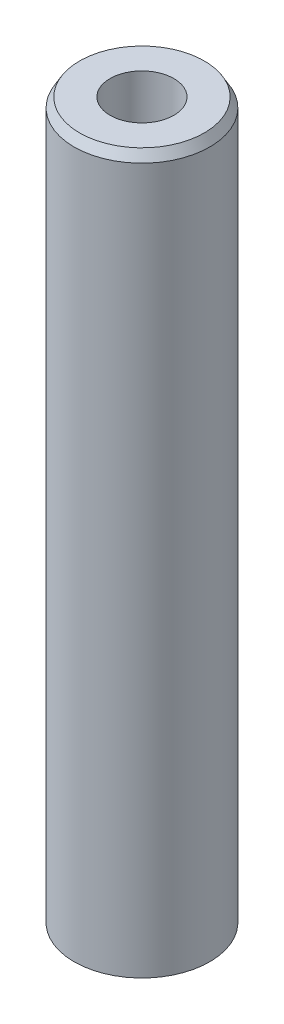
ISO-10303-21;
HEADER;
FILE_DESCRIPTION(('STEP AP214'),'2;1');
FILE_NAME('part.step','',(''),(''),'','','');
FILE_SCHEMA(('AUTOMOTIVE_DESIGN { 1 0 10303 214 1 1 1 1 }'));
ENDSEC;
DATA;
#1=APPLICATION_CONTEXT('core data for automotive mechanical design processes');
#2=APPLICATION_PROTOCOL_DEFINITION('international standard','automotive_design',2000,#1);
#3=PRODUCT_CONTEXT('',#1,'mechanical');
#4=PRODUCT('Part','Part','',(#3));
#5=PRODUCT_RELATED_PRODUCT_CATEGORY('part','',(#4));
#6=PRODUCT_DEFINITION_FORMATION('','',#4);
#7=PRODUCT_DEFINITION_CONTEXT('part definition',#1,'design');
#8=PRODUCT_DEFINITION('design','',#6,#7);
#9=PRODUCT_DEFINITION_SHAPE('','',#8);
#10=(LENGTH_UNIT() NAMED_UNIT(*) SI_UNIT(.MILLI.,.METRE.));
#11=(NAMED_UNIT(*) PLANE_ANGLE_UNIT() SI_UNIT($,.RADIAN.));
#12=(NAMED_UNIT(*) SI_UNIT($,.STERADIAN.) SOLID_ANGLE_UNIT());
#13=UNCERTAINTY_MEASURE_WITH_UNIT(LENGTH_MEASURE(1.E-05),#10,'distance_accuracy_value','');
#14=(GEOMETRIC_REPRESENTATION_CONTEXT(3) GLOBAL_UNCERTAINTY_ASSIGNED_CONTEXT((#13)) GLOBAL_UNIT_ASSIGNED_CONTEXT((#10,
#11,#12)) REPRESENTATION_CONTEXT('',''));
#15=CARTESIAN_POINT('',(0.,0.,0.));
#16=DIRECTION('',(0.,0.,1.));
#17=DIRECTION('',(1.,0.,0.));
#18=AXIS2_PLACEMENT_3D('',#15,#16,#17);
#19=CARTESIAN_POINT('',(0.,212.45765458516,0.));
#20=DIRECTION('',(0.,-1.,0.));
#21=DIRECTION('',(0.,0.,-1.));
#22=AXIS2_PLACEMENT_3D('',#19,#20,#21);
#23=CYLINDRICAL_SURFACE('',#22,20.);
#24=CARTESIAN_POINT('',(0.,209.670040838824,0.));
#25=DIRECTION('',(0.,1.,0.));
#26=DIRECTION('',(0.,0.,1.));
#27=AXIS2_PLACEMENT_3D('',#24,#25,#26);
#28=CIRCLE('',#27,20.);
#29=CARTESIAN_POINT('',(0.,209.670040838824,20.));
#30=VERTEX_POINT('',#29);
#31=EDGE_CURVE('E50',#30,#30,#28,.F.);
#32=ORIENTED_EDGE('',*,*,#31,.T.);
#33=EDGE_LOOP('',(#32));
#34=FACE_BOUND('',#33,.T.);
#35=CARTESIAN_POINT('',(0.,1.60942954684379,0.));
#36=DIRECTION('',(0.,1.,0.));
#37=DIRECTION('',(0.,0.,1.));
#38=AXIS2_PLACEMENT_3D('',#35,#36,#37);
#39=CIRCLE('',#38,20.);
#40=CARTESIAN_POINT('',(0.,1.60942954684379,20.));
#41=VERTEX_POINT('',#40);
#42=EDGE_CURVE('E51',#41,#41,#39,.T.);
#43=ORIENTED_EDGE('',*,*,#42,.T.);
#44=EDGE_LOOP('',(#43));
#45=FACE_BOUND('',#44,.T.);
#46=ADVANCED_FACE('F39',(#34,#45),#23,.T.);
#47=CARTESIAN_POINT('',(0.,212.45765458516,0.));
#48=DIRECTION('',(0.,1.,0.));
#49=DIRECTION('',(0.,0.,1.));
#50=AXIS2_PLACEMENT_3D('',#47,#48,#49);
#51=PLANE('',#50);
#52=CARTESIAN_POINT('',(0.,212.45765458516,0.));
#53=DIRECTION('',(0.,1.,0.));
#54=DIRECTION('',(0.,0.,1.));
#55=AXIS2_PLACEMENT_3D('',#52,#53,#54);
#56=CIRCLE('',#55,18.3905704531562);
#57=CARTESIAN_POINT('',(0.,212.45765458516,18.3905704531562));
#58=VERTEX_POINT('',#57);
#59=EDGE_CURVE('E54',#58,#58,#56,.T.);
#60=ORIENTED_EDGE('',*,*,#59,.T.);
#61=EDGE_LOOP('',(#60));
#62=FACE_BOUND('',#61,.T.);
#63=CARTESIAN_POINT('',(0.,212.45765458516,0.));
#64=DIRECTION('',(0.,1.,0.));
#65=DIRECTION('',(0.,0.,1.));
#66=AXIS2_PLACEMENT_3D('',#63,#64,#65);
#67=CIRCLE('',#66,9.40361315145759);
#68=CARTESIAN_POINT('',(0.,212.45765458516,9.40361315145759));
#69=VERTEX_POINT('',#68);
#70=EDGE_CURVE('E58',#69,#69,#67,.T.);
#71=ORIENTED_EDGE('',*,*,#70,.F.);
#72=EDGE_LOOP('',(#71));
#73=FACE_BOUND('',#72,.T.);
#74=ADVANCED_FACE('F69',(#62,#73),#51,.T.);
#75=CARTESIAN_POINT('',(0.,0.,0.));
#76=DIRECTION('',(0.,1.,0.));
#77=DIRECTION('',(0.,0.,1.));
#78=AXIS2_PLACEMENT_3D('',#75,#76,#77);
#79=PLANE('',#78);
#80=CARTESIAN_POINT('',(0.,0.,0.));
#81=DIRECTION('',(0.,1.,0.));
#82=DIRECTION('',(0.,0.,1.));
#83=AXIS2_PLACEMENT_3D('',#80,#81,#82);
#84=CIRCLE('',#83,17.212386253664);
#85=CARTESIAN_POINT('',(0.,0.,17.212386253664));
#86=VERTEX_POINT('',#85);
#87=EDGE_CURVE('E10',#86,#86,#84,.F.);
#88=ORIENTED_EDGE('',*,*,#87,.T.);
#89=EDGE_LOOP('',(#88));
#90=FACE_BOUND('',#89,.T.);
#91=CARTESIAN_POINT('',(0.,0.,0.));
#92=DIRECTION('',(0.,1.,0.));
#93=DIRECTION('',(0.,0.,1.));
#94=AXIS2_PLACEMENT_3D('',#91,#92,#93);
#95=CIRCLE('',#94,9.40361315145759);
#96=CARTESIAN_POINT('',(0.,0.,9.40361315145759));
#97=VERTEX_POINT('',#96);
#98=EDGE_CURVE('E63',#97,#97,#95,.T.);
#99=ORIENTED_EDGE('',*,*,#98,.T.);
#100=EDGE_LOOP('',(#99));
#101=FACE_BOUND('',#100,.T.);
#102=ADVANCED_FACE('F75',(#90,#101),#79,.F.);
#103=CARTESIAN_POINT('',(0.,212.45765458516,0.));
#104=DIRECTION('',(0.,-1.,0.));
#105=DIRECTION('',(0.,0.,-1.));
#106=AXIS2_PLACEMENT_3D('',#103,#104,#105);
#107=CYLINDRICAL_SURFACE('',#106,9.40361315145759);
#108=ORIENTED_EDGE('',*,*,#70,.T.);
#109=EDGE_LOOP('',(#108));
#110=FACE_BOUND('',#109,.T.);
#111=ORIENTED_EDGE('',*,*,#98,.F.);
#112=EDGE_LOOP('',(#111));
#113=FACE_BOUND('',#112,.T.);
#114=ADVANCED_FACE('F70',(#110,#113),#107,.F.);
#115=CARTESIAN_POINT('',(0.,212.45765458516,0.));
#116=DIRECTION('',(0.,-1.,0.));
#117=DIRECTION('',(0.,0.,-1.));
#118=AXIS2_PLACEMENT_3D('',#115,#116,#117);
#119=CONICAL_SURFACE('',#118,18.3905704531562,0.523598775598294);
#120=ORIENTED_EDGE('',*,*,#31,.F.);
#121=EDGE_LOOP('',(#120));
#122=FACE_BOUND('',#121,.T.);
#123=ORIENTED_EDGE('',*,*,#59,.F.);
#124=EDGE_LOOP('',(#123));
#125=FACE_BOUND('',#124,.T.);
#126=ADVANCED_FACE('F81',(#122,#125),#119,.T.);
#127=CARTESIAN_POINT('',(0.,1.60942954684379,0.));
#128=DIRECTION('',(0.,1.,0.));
#129=DIRECTION('',(0.,0.,1.));
#130=AXIS2_PLACEMENT_3D('',#127,#128,#129);
#131=CONICAL_SURFACE('',#130,20.,1.0471975511966);
#132=ORIENTED_EDGE('',*,*,#87,.F.);
#133=EDGE_LOOP('',(#132));
#134=FACE_BOUND('',#133,.T.);
#135=ORIENTED_EDGE('',*,*,#42,.F.);
#136=EDGE_LOOP('',(#135));
#137=FACE_BOUND('',#136,.T.);
#138=ADVANCED_FACE('F45',(#134,#137),#131,.T.);
#139=CLOSED_SHELL('',(#46,#74,#102,#114,#126,#138));
#140=MANIFOLD_SOLID_BREP('B2',#139);
#141=ADVANCED_BREP_SHAPE_REPRESENTATION('',(#18,#140),#14);
#142=SHAPE_DEFINITION_REPRESENTATION(#9,#141);
ENDSEC;
END-ISO-10303-21;
